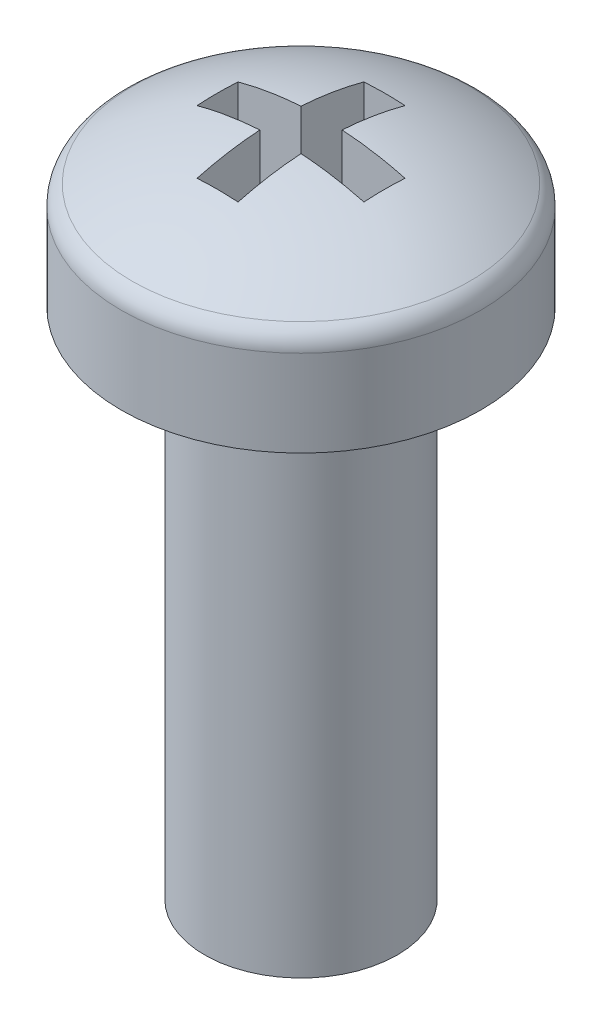
ISO-10303-21;
HEADER;
FILE_DESCRIPTION(('STEP AP214'),'2;1');
FILE_NAME('part.step','',(''),(''),'','','');
FILE_SCHEMA(('AUTOMOTIVE_DESIGN { 1 0 10303 214 1 1 1 1 }'));
ENDSEC;
DATA;
#1=APPLICATION_CONTEXT('core data for automotive mechanical design processes');
#2=APPLICATION_PROTOCOL_DEFINITION('international standard','automotive_design',2000,#1);
#3=PRODUCT_CONTEXT('',#1,'mechanical');
#4=PRODUCT('Part','Part','',(#3));
#5=PRODUCT_RELATED_PRODUCT_CATEGORY('part','',(#4));
#6=PRODUCT_DEFINITION_FORMATION('','',#4);
#7=PRODUCT_DEFINITION_CONTEXT('part definition',#1,'design');
#8=PRODUCT_DEFINITION('design','',#6,#7);
#9=PRODUCT_DEFINITION_SHAPE('','',#8);
#10=(LENGTH_UNIT() NAMED_UNIT(*) SI_UNIT(.MILLI.,.METRE.));
#11=(NAMED_UNIT(*) PLANE_ANGLE_UNIT() SI_UNIT($,.RADIAN.));
#12=(NAMED_UNIT(*) SI_UNIT($,.STERADIAN.) SOLID_ANGLE_UNIT());
#13=UNCERTAINTY_MEASURE_WITH_UNIT(LENGTH_MEASURE(1.E-05),#10,'distance_accuracy_value','');
#14=(GEOMETRIC_REPRESENTATION_CONTEXT(3) GLOBAL_UNCERTAINTY_ASSIGNED_CONTEXT((#13)) GLOBAL_UNIT_ASSIGNED_CONTEXT((#10,
#11,#12)) REPRESENTATION_CONTEXT('',''));
#15=CARTESIAN_POINT('',(0.,0.,0.));
#16=DIRECTION('',(0.,0.,1.));
#17=DIRECTION('',(1.,0.,0.));
#18=AXIS2_PLACEMENT_3D('',#15,#16,#17);
#19=CARTESIAN_POINT('',(0.32,0.64,1.3));
#20=DIRECTION('',(1.,0.,0.));
#21=DIRECTION('',(0.,0.,-1.));
#22=AXIS2_PLACEMENT_3D('',#19,#20,#21);
#23=PLANE('',#22);
#24=DIRECTION('',(0.,1.,0.));
#25=VECTOR('',#24,1.);
#26=CARTESIAN_POINT('',(0.320000000000001,0.64,0.32));
#27=LINE('',#26,#25);
#28=CARTESIAN_POINT('',(0.320000000000048,2.37947788427662,0.319999999999969));
#29=VERTEX_POINT('',#28);
#30=CARTESIAN_POINT('',(0.320000000000001,0.64,0.32));
#31=VERTEX_POINT('',#30);
#32=EDGE_CURVE('E94',#29,#31,#27,.F.);
#33=ORIENTED_EDGE('',*,*,#32,.T.);
#34=DIRECTION('',(0.,0.,-1.));
#35=VECTOR('',#34,1.);
#36=CARTESIAN_POINT('',(0.32,0.64,1.3));
#37=LINE('',#36,#35);
#38=CARTESIAN_POINT('',(0.32,0.64,1.3));
#39=VERTEX_POINT('',#38);
#40=EDGE_CURVE('E95',#39,#31,#37,.T.);
#41=ORIENTED_EDGE('',*,*,#40,.F.);
#42=DIRECTION('',(0.,1.,0.));
#43=VECTOR('',#42,1.);
#44=CARTESIAN_POINT('',(0.32,0.64,1.3));
#45=LINE('',#44,#43);
#46=CARTESIAN_POINT('',(0.32,2.21742669897529,1.3));
#47=VERTEX_POINT('',#46);
#48=EDGE_CURVE('E86',#47,#39,#45,.F.);
#49=ORIENTED_EDGE('',*,*,#48,.F.);
#50=CARTESIAN_POINT('',(0.319999999999999,-2.6,0.));
#51=DIRECTION('',(1.,0.,0.));
#52=DIRECTION('',(0.,0.,-1.));
#53=AXIS2_PLACEMENT_3D('',#50,#51,#52);
#54=CIRCLE('',#53,4.98974949271003);
#55=EDGE_CURVE('E19',#29,#47,#54,.T.);
#56=ORIENTED_EDGE('',*,*,#55,.F.);
#57=EDGE_LOOP('',(#33,#41,#49,#56));
#58=FACE_BOUND('',#57,.T.);
#59=ADVANCED_FACE('F16',(#58),#23,.F.);
#60=CARTESIAN_POINT('',(0.32,0.64,0.32));
#61=DIRECTION('',(0.,0.,1.));
#62=DIRECTION('',(1.,0.,0.));
#63=AXIS2_PLACEMENT_3D('',#60,#61,#62);
#64=PLANE('',#63);
#65=DIRECTION('',(0.,1.,0.));
#66=VECTOR('',#65,1.);
#67=CARTESIAN_POINT('',(1.3,0.64,0.32));
#68=LINE('',#67,#66);
#69=CARTESIAN_POINT('',(1.3,2.21742669897529,0.32));
#70=VERTEX_POINT('',#69);
#71=CARTESIAN_POINT('',(1.3,0.64,0.32));
#72=VERTEX_POINT('',#71);
#73=EDGE_CURVE('E227',#70,#72,#68,.F.);
#74=ORIENTED_EDGE('',*,*,#73,.T.);
#75=DIRECTION('',(1.,0.,0.));
#76=VECTOR('',#75,1.);
#77=CARTESIAN_POINT('',(0.32,0.64,0.32));
#78=LINE('',#77,#76);
#79=EDGE_CURVE('E248',#31,#72,#78,.T.);
#80=ORIENTED_EDGE('',*,*,#79,.F.);
#81=ORIENTED_EDGE('',*,*,#32,.F.);
#82=CARTESIAN_POINT('',(1.3,2.21742669897529,0.32));
#83=CARTESIAN_POINT('',(1.13936164818204,2.26073305501907,0.32000000000001));
#84=CARTESIAN_POINT('',(0.977375805606398,2.29589049848273,0.32000000000001));
#85=CARTESIAN_POINT('',(0.650709138939763,2.34990756024984,0.31999999999999));
#86=CARTESIAN_POINT('',(0.486028314848768,2.36876717855329,0.319999999999969));
#87=CARTESIAN_POINT('',(0.320000000000096,2.37947788427662,0.319999999999939));
#88=B_SPLINE_CURVE_WITH_KNOTS('',3,(#82,#83,#84,#85,#86,#87),.UNSPECIFIED.,.F.,.F.,(4,2,4),(0.,
0.497271687543708,0.994543375087416),.UNSPECIFIED.);
#89=EDGE_CURVE('E92',#70,#29,#88,.T.);
#90=ORIENTED_EDGE('',*,*,#89,.F.);
#91=EDGE_LOOP('',(#74,#80,#81,#90));
#92=FACE_BOUND('',#91,.T.);
#93=ADVANCED_FACE('F262',(#92),#64,.F.);
#94=CARTESIAN_POINT('',(-0.32,0.64,-0.32));
#95=DIRECTION('',(0.,0.,-1.));
#96=DIRECTION('',(-1.,0.,0.));
#97=AXIS2_PLACEMENT_3D('',#94,#95,#96);
#98=PLANE('',#97);
#99=DIRECTION('',(0.,1.,0.));
#100=VECTOR('',#99,1.);
#101=CARTESIAN_POINT('',(-1.3,0.64,-0.32));
#102=LINE('',#101,#100);
#103=CARTESIAN_POINT('',(-1.3,0.64,-0.32));
#104=VERTEX_POINT('',#103);
#105=CARTESIAN_POINT('',(-1.3,2.21742669897529,-0.32));
#106=VERTEX_POINT('',#105);
#107=EDGE_CURVE('E238',#104,#106,#102,.T.);
#108=ORIENTED_EDGE('',*,*,#107,.F.);
#109=DIRECTION('',(-1.,0.,0.));
#110=VECTOR('',#109,1.);
#111=CARTESIAN_POINT('',(-0.32,0.64,-0.32));
#112=LINE('',#111,#110);
#113=CARTESIAN_POINT('',(-0.32,0.64,-0.32));
#114=VERTEX_POINT('',#113);
#115=EDGE_CURVE('E240',#114,#104,#112,.T.);
#116=ORIENTED_EDGE('',*,*,#115,.F.);
#117=DIRECTION('',(0.,1.,0.));
#118=VECTOR('',#117,1.);
#119=CARTESIAN_POINT('',(-0.32,0.64,-0.32));
#120=LINE('',#119,#118);
#121=CARTESIAN_POINT('',(-0.320000000000047,2.37947788427662,-0.319999999999972));
#122=VERTEX_POINT('',#121);
#123=EDGE_CURVE('E216',#114,#122,#120,.T.);
#124=ORIENTED_EDGE('',*,*,#123,.T.);
#125=CARTESIAN_POINT('',(-1.3,2.21742669897529,-0.319999999999997));
#126=CARTESIAN_POINT('',(-1.13936164818204,2.26073305501907,-0.320000000000008));
#127=CARTESIAN_POINT('',(-0.977375805606398,2.29589049848273,-0.320000000000009));
#128=CARTESIAN_POINT('',(-0.650709138939762,2.34990756024984,-0.319999999999991));
#129=CARTESIAN_POINT('',(-0.486028314848767,2.36876717855329,-0.319999999999971));
#130=CARTESIAN_POINT('',(-0.320000000000095,2.37947788427662,-0.319999999999941));
#131=B_SPLINE_CURVE_WITH_KNOTS('',3,(#125,#126,#127,#128,#129,#130),.UNSPECIFIED.,.F.,.F.,(4,2,
4),(0.,0.497271687543709,0.994543375087418),.UNSPECIFIED.);
#132=EDGE_CURVE('E231',#106,#122,#131,.T.);
#133=ORIENTED_EDGE('',*,*,#132,.F.);
#134=EDGE_LOOP('',(#108,#116,#124,#133));
#135=FACE_BOUND('',#134,.T.);
#136=ADVANCED_FACE('F265',(#135),#98,.F.);
#137=CARTESIAN_POINT('',(1.3,0.64,0.32));
#138=DIRECTION('',(1.,0.,0.));
#139=DIRECTION('',(0.,0.,-1.));
#140=AXIS2_PLACEMENT_3D('',#137,#138,#139);
#141=PLANE('',#140);
#142=DIRECTION('',(0.,1.,0.));
#143=VECTOR('',#142,1.);
#144=CARTESIAN_POINT('',(1.3,0.64,-0.32));
#145=LINE('',#144,#143);
#146=CARTESIAN_POINT('',(1.3,2.21742669897529,-0.319999999999999));
#147=VERTEX_POINT('',#146);
#148=CARTESIAN_POINT('',(1.3,0.64,-0.32));
#149=VERTEX_POINT('',#148);
#150=EDGE_CURVE('E205',#147,#149,#145,.F.);
#151=ORIENTED_EDGE('',*,*,#150,.T.);
#152=DIRECTION('',(0.,0.,-1.));
#153=VECTOR('',#152,1.);
#154=CARTESIAN_POINT('',(1.3,0.64,0.32));
#155=LINE('',#154,#153);
#156=EDGE_CURVE('E230',#72,#149,#155,.T.);
#157=ORIENTED_EDGE('',*,*,#156,.F.);
#158=ORIENTED_EDGE('',*,*,#73,.F.);
#159=CARTESIAN_POINT('',(1.3,-2.6,0.));
#160=DIRECTION('',(1.,0.,0.));
#161=DIRECTION('',(0.,0.,-1.));
#162=AXIS2_PLACEMENT_3D('',#159,#160,#161);
#163=CIRCLE('',#162,4.82804308182932);
#164=EDGE_CURVE('E224',#147,#70,#163,.T.);
#165=ORIENTED_EDGE('',*,*,#164,.F.);
#166=EDGE_LOOP('',(#151,#157,#158,#165));
#167=FACE_BOUND('',#166,.T.);
#168=ADVANCED_FACE('F270',(#167),#141,.F.);
#169=CARTESIAN_POINT('',(-0.32,0.64,-1.3));
#170=DIRECTION('',(-1.,0.,0.));
#171=DIRECTION('',(0.,0.,1.));
#172=AXIS2_PLACEMENT_3D('',#169,#170,#171);
#173=PLANE('',#172);
#174=ORIENTED_EDGE('',*,*,#123,.F.);
#175=DIRECTION('',(0.,0.,1.));
#176=VECTOR('',#175,1.);
#177=CARTESIAN_POINT('',(-0.32,0.64,-1.3));
#178=LINE('',#177,#176);
#179=CARTESIAN_POINT('',(-0.32,0.64,-1.3));
#180=VERTEX_POINT('',#179);
#181=EDGE_CURVE('E219',#180,#114,#178,.T.);
#182=ORIENTED_EDGE('',*,*,#181,.F.);
#183=DIRECTION('',(0.,1.,0.));
#184=VECTOR('',#183,1.);
#185=CARTESIAN_POINT('',(-0.32,0.64,-1.3));
#186=LINE('',#185,#184);
#187=CARTESIAN_POINT('',(-0.320000000000001,2.21742669897529,-1.3));
#188=VERTEX_POINT('',#187);
#189=EDGE_CURVE('E190',#180,#188,#186,.T.);
#190=ORIENTED_EDGE('',*,*,#189,.T.);
#191=CARTESIAN_POINT('',(-0.320000000000001,-2.6,0.));
#192=DIRECTION('',(1.,0.,0.));
#193=DIRECTION('',(0.,0.,-1.));
#194=AXIS2_PLACEMENT_3D('',#191,#192,#193);
#195=CIRCLE('',#194,4.98974949271003);
#196=EDGE_CURVE('E209',#122,#188,#195,.F.);
#197=ORIENTED_EDGE('',*,*,#196,.F.);
#198=EDGE_LOOP('',(#174,#182,#190,#197));
#199=FACE_BOUND('',#198,.T.);
#200=ADVANCED_FACE('F274',(#199),#173,.F.);
#201=CARTESIAN_POINT('',(1.3,0.64,-0.32));
#202=DIRECTION('',(0.,0.,-1.));
#203=DIRECTION('',(-1.,0.,0.));
#204=AXIS2_PLACEMENT_3D('',#201,#202,#203);
#205=PLANE('',#204);
#206=DIRECTION('',(0.,1.,0.));
#207=VECTOR('',#206,1.);
#208=CARTESIAN_POINT('',(0.32,0.64,-0.320000000000001));
#209=LINE('',#208,#207);
#210=CARTESIAN_POINT('',(0.32,2.37947788427662,-0.320000000000002));
#211=VERTEX_POINT('',#210);
#212=CARTESIAN_POINT('',(0.32,0.64,-0.320000000000001));
#213=VERTEX_POINT('',#212);
#214=EDGE_CURVE('E182',#211,#213,#209,.F.);
#215=ORIENTED_EDGE('',*,*,#214,.T.);
#216=DIRECTION('',(-1.,0.,0.));
#217=VECTOR('',#216,1.);
#218=CARTESIAN_POINT('',(1.3,0.64,-0.32));
#219=LINE('',#218,#217);
#220=EDGE_CURVE('E208',#149,#213,#219,.T.);
#221=ORIENTED_EDGE('',*,*,#220,.F.);
#222=ORIENTED_EDGE('',*,*,#150,.F.);
#223=CARTESIAN_POINT('',(0.320000000000001,2.37947788427662,-0.320000000000003));
#224=CARTESIAN_POINT('',(0.48602831484869,2.36876717855329,-0.320000000000002));
#225=CARTESIAN_POINT('',(0.650709138939701,2.34990756024985,-0.320000000000001));
#226=CARTESIAN_POINT('',(0.977375805606367,2.29589049848274,-0.319999999999999));
#227=CARTESIAN_POINT('',(1.13936164818202,2.26073305501907,-0.319999999999998));
#228=CARTESIAN_POINT('',(1.3,2.21742669897529,-0.319999999999997));
#229=B_SPLINE_CURVE_WITH_KNOTS('',3,(#223,#224,#225,#226,#227,#228),.UNSPECIFIED.,.F.,.F.,(4,2,
4),(0.,0.497271687543756,0.994543375087511),.UNSPECIFIED.);
#230=EDGE_CURVE('E198',#211,#147,#229,.T.);
#231=ORIENTED_EDGE('',*,*,#230,.F.);
#232=EDGE_LOOP('',(#215,#221,#222,#231));
#233=FACE_BOUND('',#232,.T.);
#234=ADVANCED_FACE('F278',(#233),#205,.F.);
#235=CARTESIAN_POINT('',(0.32,0.64,-1.3));
#236=DIRECTION('',(0.,0.,-1.));
#237=DIRECTION('',(-1.,0.,0.));
#238=AXIS2_PLACEMENT_3D('',#235,#236,#237);
#239=PLANE('',#238);
#240=ORIENTED_EDGE('',*,*,#189,.F.);
#241=DIRECTION('',(-1.,0.,0.));
#242=VECTOR('',#241,1.);
#243=CARTESIAN_POINT('',(0.32,0.64,-1.3));
#244=LINE('',#243,#242);
#245=CARTESIAN_POINT('',(0.32,0.64,-1.3));
#246=VERTEX_POINT('',#245);
#247=EDGE_CURVE('E193',#246,#180,#244,.T.);
#248=ORIENTED_EDGE('',*,*,#247,.F.);
#249=DIRECTION('',(0.,1.,0.));
#250=VECTOR('',#249,1.);
#251=CARTESIAN_POINT('',(0.32,0.64,-1.3));
#252=LINE('',#251,#250);
#253=CARTESIAN_POINT('',(0.32,2.21742669897529,-1.3));
#254=VERTEX_POINT('',#253);
#255=EDGE_CURVE('E179',#246,#254,#252,.T.);
#256=ORIENTED_EDGE('',*,*,#255,.T.);
#257=CARTESIAN_POINT('',(-0.320000000000001,2.21742669897529,-1.3));
#258=CARTESIAN_POINT('',(-0.213333333333334,2.22450428754465,-1.3));
#259=CARTESIAN_POINT('',(-0.106666666666667,2.22804308182933,-1.3));
#260=CARTESIAN_POINT('',(0.106666666666666,2.22804308182933,-1.3));
#261=CARTESIAN_POINT('',(0.213333333333333,2.22450428754465,-1.3));
#262=CARTESIAN_POINT('',(0.32,2.21742669897529,-1.3));
#263=B_SPLINE_CURVE_WITH_KNOTS('',3,(#257,#258,#259,#260,#261,#262),.UNSPECIFIED.,.F.,.F.,(4,2,
4),(0.,0.320176057169963,0.640352114339926),.UNSPECIFIED.);
#264=EDGE_CURVE('E187',#188,#254,#263,.T.);
#265=ORIENTED_EDGE('',*,*,#264,.F.);
#266=EDGE_LOOP('',(#240,#248,#256,#265));
#267=FACE_BOUND('',#266,.T.);
#268=ADVANCED_FACE('F283',(#267),#239,.F.);
#269=CARTESIAN_POINT('',(0.32,0.64,-0.32));
#270=DIRECTION('',(1.,0.,0.));
#271=DIRECTION('',(0.,0.,-1.));
#272=AXIS2_PLACEMENT_3D('',#269,#270,#271);
#273=PLANE('',#272);
#274=ORIENTED_EDGE('',*,*,#255,.F.);
#275=DIRECTION('',(0.,0.,1.));
#276=VECTOR('',#275,1.);
#277=CARTESIAN_POINT('',(0.32,0.64,0.));
#278=LINE('',#277,#276);
#279=EDGE_CURVE('E163',#213,#246,#278,.F.);
#280=ORIENTED_EDGE('',*,*,#279,.F.);
#281=ORIENTED_EDGE('',*,*,#214,.F.);
#282=CARTESIAN_POINT('',(0.319999999999999,-2.6,0.));
#283=DIRECTION('',(1.,0.,0.));
#284=DIRECTION('',(0.,0.,-1.));
#285=AXIS2_PLACEMENT_3D('',#282,#283,#284);
#286=CIRCLE('',#285,4.98974949271003);
#287=EDGE_CURVE('E100',#254,#211,#286,.T.);
#288=ORIENTED_EDGE('',*,*,#287,.F.);
#289=EDGE_LOOP('',(#274,#280,#281,#288));
#290=FACE_BOUND('',#289,.T.);
#291=ADVANCED_FACE('F340',(#290),#273,.F.);
#292=CARTESIAN_POINT('',(-0.32,0.64,1.3));
#293=DIRECTION('',(0.,0.,1.));
#294=DIRECTION('',(1.,0.,0.));
#295=AXIS2_PLACEMENT_3D('',#292,#293,#294);
#296=PLANE('',#295);
#297=ORIENTED_EDGE('',*,*,#48,.T.);
#298=DIRECTION('',(1.,0.,0.));
#299=VECTOR('',#298,1.);
#300=CARTESIAN_POINT('',(0.,0.64,1.3));
#301=LINE('',#300,#299);
#302=CARTESIAN_POINT('',(-0.32,0.64,1.3));
#303=VERTEX_POINT('',#302);
#304=EDGE_CURVE('E173',#303,#39,#301,.T.);
#305=ORIENTED_EDGE('',*,*,#304,.F.);
#306=DIRECTION('',(0.,1.,0.));
#307=VECTOR('',#306,1.);
#308=CARTESIAN_POINT('',(-0.32,0.64,1.3));
#309=LINE('',#308,#307);
#310=CARTESIAN_POINT('',(-0.320000000000001,2.21742669897529,1.3));
#311=VERTEX_POINT('',#310);
#312=EDGE_CURVE('E98',#303,#311,#309,.T.);
#313=ORIENTED_EDGE('',*,*,#312,.T.);
#314=CARTESIAN_POINT('',(0.32,2.21742669897529,1.3));
#315=CARTESIAN_POINT('',(0.213333333333333,2.22450428754465,1.3));
#316=CARTESIAN_POINT('',(0.106666666666666,2.22804308182933,1.3));
#317=CARTESIAN_POINT('',(-0.106666666666667,2.22804308182933,1.3));
#318=CARTESIAN_POINT('',(-0.213333333333334,2.22450428754465,1.3));
#319=CARTESIAN_POINT('',(-0.32,2.21742669897529,1.3));
#320=B_SPLINE_CURVE_WITH_KNOTS('',3,(#314,#315,#316,#317,#318,#319),.UNSPECIFIED.,.F.,.F.,(4,2,
4),(0.,0.320176057169963,0.640352114339926),.UNSPECIFIED.);
#321=EDGE_CURVE('E89',#47,#311,#320,.T.);
#322=ORIENTED_EDGE('',*,*,#321,.F.);
#323=EDGE_LOOP('',(#297,#305,#313,#322));
#324=FACE_BOUND('',#323,.T.);
#325=ADVANCED_FACE('F96',(#324),#296,.F.);
#326=CARTESIAN_POINT('',(-1.3,0.64,-0.32));
#327=DIRECTION('',(-1.,0.,0.));
#328=DIRECTION('',(0.,0.,1.));
#329=AXIS2_PLACEMENT_3D('',#326,#327,#328);
#330=PLANE('',#329);
#331=DIRECTION('',(0.,1.,0.));
#332=VECTOR('',#331,1.);
#333=CARTESIAN_POINT('',(-1.3,0.64,0.32));
#334=LINE('',#333,#332);
#335=CARTESIAN_POINT('',(-1.3,2.21742669897529,0.32));
#336=VERTEX_POINT('',#335);
#337=CARTESIAN_POINT('',(-1.3,0.64,0.32));
#338=VERTEX_POINT('',#337);
#339=EDGE_CURVE('E152',#336,#338,#334,.F.);
#340=ORIENTED_EDGE('',*,*,#339,.T.);
#341=DIRECTION('',(0.,0.,1.));
#342=VECTOR('',#341,1.);
#343=CARTESIAN_POINT('',(-1.3,0.64,0.));
#344=LINE('',#343,#342);
#345=EDGE_CURVE('E170',#104,#338,#344,.T.);
#346=ORIENTED_EDGE('',*,*,#345,.F.);
#347=ORIENTED_EDGE('',*,*,#107,.T.);
#348=CARTESIAN_POINT('',(-1.3,-2.6,0.));
#349=DIRECTION('',(1.,0.,0.));
#350=DIRECTION('',(0.,0.,-1.));
#351=AXIS2_PLACEMENT_3D('',#348,#349,#350);
#352=CIRCLE('',#351,4.82804308182932);
#353=EDGE_CURVE('E99',#336,#106,#352,.F.);
#354=ORIENTED_EDGE('',*,*,#353,.F.);
#355=EDGE_LOOP('',(#340,#346,#347,#354));
#356=FACE_BOUND('',#355,.T.);
#357=ADVANCED_FACE('F348',(#356),#330,.F.);
#358=CARTESIAN_POINT('',(0.,0.64,0.));
#359=DIRECTION('',(0.,1.,0.));
#360=DIRECTION('',(0.,0.,1.));
#361=AXIS2_PLACEMENT_3D('',#358,#359,#360);
#362=PLANE('',#361);
#363=ORIENTED_EDGE('',*,*,#279,.T.);
#364=ORIENTED_EDGE('',*,*,#247,.T.);
#365=ORIENTED_EDGE('',*,*,#181,.T.);
#366=ORIENTED_EDGE('',*,*,#115,.T.);
#367=ORIENTED_EDGE('',*,*,#345,.T.);
#368=DIRECTION('',(1.,0.,0.));
#369=VECTOR('',#368,1.);
#370=CARTESIAN_POINT('',(-1.3,0.64,0.32));
#371=LINE('',#370,#369);
#372=CARTESIAN_POINT('',(-0.32,0.64,0.32));
#373=VERTEX_POINT('',#372);
#374=EDGE_CURVE('E149',#338,#373,#371,.T.);
#375=ORIENTED_EDGE('',*,*,#374,.T.);
#376=DIRECTION('',(0.,0.,1.));
#377=VECTOR('',#376,1.);
#378=CARTESIAN_POINT('',(-0.32,0.64,0.32));
#379=LINE('',#378,#377);
#380=EDGE_CURVE('E158',#373,#303,#379,.T.);
#381=ORIENTED_EDGE('',*,*,#380,.T.);
#382=ORIENTED_EDGE('',*,*,#304,.T.);
#383=ORIENTED_EDGE('',*,*,#40,.T.);
#384=ORIENTED_EDGE('',*,*,#79,.T.);
#385=ORIENTED_EDGE('',*,*,#156,.T.);
#386=ORIENTED_EDGE('',*,*,#220,.T.);
#387=EDGE_LOOP('',(#363,#364,#365,#366,#367,#375,#381,#382,#383,#384,#385,#386));
#388=FACE_BOUND('',#387,.T.);
#389=ADVANCED_FACE('F316',(#388),#362,.T.);
#390=CARTESIAN_POINT('',(-0.32,0.64,0.32));
#391=DIRECTION('',(-1.,0.,0.));
#392=DIRECTION('',(0.,0.,1.));
#393=AXIS2_PLACEMENT_3D('',#390,#391,#392);
#394=PLANE('',#393);
#395=ORIENTED_EDGE('',*,*,#312,.F.);
#396=ORIENTED_EDGE('',*,*,#380,.F.);
#397=DIRECTION('',(0.,1.,0.));
#398=VECTOR('',#397,1.);
#399=CARTESIAN_POINT('',(-0.32,0.64,0.32));
#400=LINE('',#399,#398);
#401=CARTESIAN_POINT('',(-0.32,2.37947788427662,0.32));
#402=VERTEX_POINT('',#401);
#403=EDGE_CURVE('E129',#373,#402,#400,.T.);
#404=ORIENTED_EDGE('',*,*,#403,.T.);
#405=CARTESIAN_POINT('',(-0.320000000000001,-2.6,0.));
#406=DIRECTION('',(1.,0.,0.));
#407=DIRECTION('',(0.,0.,-1.));
#408=AXIS2_PLACEMENT_3D('',#405,#406,#407);
#409=CIRCLE('',#408,4.98974949271003);
#410=EDGE_CURVE('E34',#311,#402,#409,.F.);
#411=ORIENTED_EDGE('',*,*,#410,.F.);
#412=EDGE_LOOP('',(#395,#396,#404,#411));
#413=FACE_BOUND('',#412,.T.);
#414=ADVANCED_FACE('F322',(#413),#394,.F.);
#415=CARTESIAN_POINT('',(-1.3,0.64,0.32));
#416=DIRECTION('',(0.,0.,1.));
#417=DIRECTION('',(1.,0.,0.));
#418=AXIS2_PLACEMENT_3D('',#415,#416,#417);
#419=PLANE('',#418);
#420=ORIENTED_EDGE('',*,*,#403,.F.);
#421=ORIENTED_EDGE('',*,*,#374,.F.);
#422=ORIENTED_EDGE('',*,*,#339,.F.);
#423=CARTESIAN_POINT('',(-0.319999999999999,2.37947788427662,0.32));
#424=CARTESIAN_POINT('',(-0.486028314848688,2.36876717855329,0.32));
#425=CARTESIAN_POINT('',(-0.6507091389397,2.34990756024985,0.32));
#426=CARTESIAN_POINT('',(-0.977375805606367,2.29589049848274,0.32));
#427=CARTESIAN_POINT('',(-1.13936164818202,2.26073305501907,0.32));
#428=CARTESIAN_POINT('',(-1.3,2.21742669897529,0.32));
#429=B_SPLINE_CURVE_WITH_KNOTS('',3,(#423,#424,#425,#426,#427,#428),.UNSPECIFIED.,.F.,.F.,(4,2,
4),(0.,0.497271687543757,0.994543375087513),.UNSPECIFIED.);
#430=EDGE_CURVE('E122',#402,#336,#429,.T.);
#431=ORIENTED_EDGE('',*,*,#430,.F.);
#432=EDGE_LOOP('',(#420,#421,#422,#431));
#433=FACE_BOUND('',#432,.T.);
#434=ADVANCED_FACE('F131',(#433),#419,.F.);
#435=CARTESIAN_POINT('',(0.,-2.6,0.));
#436=DIRECTION('',(1.,0.,0.));
#437=DIRECTION('',(0.,1.,0.));
#438=AXIS2_PLACEMENT_3D('',#435,#436,#437);
#439=SPHERICAL_SURFACE('',#438,5.);
#440=CARTESIAN_POINT('',(0.,1.65284929318952,0.));
#441=DIRECTION('',(0.,-1.,0.));
#442=DIRECTION('',(0.,0.,-1.));
#443=AXIS2_PLACEMENT_3D('',#440,#441,#442);
#444=CIRCLE('',#443,2.62931034482758);
#445=CARTESIAN_POINT('',(0.,1.65284929318952,-2.62931034482758));
#446=VERTEX_POINT('',#445);
#447=EDGE_CURVE('E119',#446,#446,#444,.T.);
#448=ORIENTED_EDGE('',*,*,#447,.F.);
#449=EDGE_LOOP('',(#448));
#450=FACE_BOUND('',#449,.T.);
#451=ORIENTED_EDGE('',*,*,#410,.T.);
#452=ORIENTED_EDGE('',*,*,#430,.T.);
#453=ORIENTED_EDGE('',*,*,#353,.T.);
#454=ORIENTED_EDGE('',*,*,#132,.T.);
#455=ORIENTED_EDGE('',*,*,#196,.T.);
#456=ORIENTED_EDGE('',*,*,#264,.T.);
#457=ORIENTED_EDGE('',*,*,#287,.T.);
#458=ORIENTED_EDGE('',*,*,#230,.T.);
#459=ORIENTED_EDGE('',*,*,#164,.T.);
#460=ORIENTED_EDGE('',*,*,#89,.T.);
#461=ORIENTED_EDGE('',*,*,#55,.T.);
#462=ORIENTED_EDGE('',*,*,#321,.T.);
#463=EDGE_LOOP('',(#451,#452,#453,#454,#455,#456,#457,#458,#459,#460,#461,#462));
#464=FACE_BOUND('',#463,.T.);
#465=ADVANCED_FACE('F88',(#450,#464),#439,.T.);
#466=CARTESIAN_POINT('',(0.,1.34664414407988,0.));
#467=DIRECTION('',(0.,-1.,0.));
#468=DIRECTION('',(0.,0.,-1.));
#469=AXIS2_PLACEMENT_3D('',#466,#467,#468);
#470=TOROIDAL_SURFACE('',#469,2.43999999999999,0.36);
#471=CARTESIAN_POINT('',(0.,1.34664414407988,0.));
#472=DIRECTION('',(0.,-1.,0.));
#473=DIRECTION('',(1.,0.,0.));
#474=AXIS2_PLACEMENT_3D('',#471,#472,#473);
#475=CIRCLE('',#474,2.79999999999999);
#476=CARTESIAN_POINT('',(2.79999999999999,1.34664414407988,0.));
#477=VERTEX_POINT('',#476);
#478=EDGE_CURVE('E118',#477,#477,#475,.T.);
#479=ORIENTED_EDGE('',*,*,#478,.F.);
#480=EDGE_LOOP('',(#479));
#481=FACE_BOUND('',#480,.T.);
#482=ORIENTED_EDGE('',*,*,#447,.T.);
#483=EDGE_LOOP('',(#482));
#484=FACE_BOUND('',#483,.T.);
#485=ADVANCED_FACE('F138',(#481,#484),#470,.T.);
#486=CARTESIAN_POINT('',(0.,2.92,0.));
#487=DIRECTION('',(0.,-1.,0.));
#488=DIRECTION('',(1.,0.,0.));
#489=AXIS2_PLACEMENT_3D('',#486,#487,#488);
#490=CYLINDRICAL_SURFACE('',#489,2.79999999999999);
#491=CARTESIAN_POINT('',(0.,0.,0.));
#492=DIRECTION('',(0.,-1.,0.));
#493=DIRECTION('',(1.,0.,0.));
#494=AXIS2_PLACEMENT_3D('',#491,#492,#493);
#495=CIRCLE('',#494,2.79999999999999);
#496=CARTESIAN_POINT('',(2.79999999999999,0.,0.));
#497=VERTEX_POINT('',#496);
#498=EDGE_CURVE('E115',#497,#497,#495,.T.);
#499=ORIENTED_EDGE('',*,*,#498,.F.);
#500=EDGE_LOOP('',(#499));
#501=FACE_BOUND('',#500,.T.);
#502=ORIENTED_EDGE('',*,*,#478,.T.);
#503=EDGE_LOOP('',(#502));
#504=FACE_BOUND('',#503,.T.);
#505=ADVANCED_FACE('F369',(#501,#504),#490,.T.);
#506=CARTESIAN_POINT('',(0.,0.,0.));
#507=DIRECTION('',(0.,-1.,0.));
#508=DIRECTION('',(1.,0.,0.));
#509=AXIS2_PLACEMENT_3D('',#506,#507,#508);
#510=PLANE('',#509);
#511=CARTESIAN_POINT('',(0.,0.,0.));
#512=DIRECTION('',(0.,-1.,0.));
#513=DIRECTION('',(1.,0.,0.));
#514=AXIS2_PLACEMENT_3D('',#511,#512,#513);
#515=CIRCLE('',#514,1.5);
#516=CARTESIAN_POINT('',(1.5,0.,0.));
#517=VERTEX_POINT('',#516);
#518=EDGE_CURVE('E25',#517,#517,#515,.T.);
#519=ORIENTED_EDGE('',*,*,#518,.F.);
#520=EDGE_LOOP('',(#519));
#521=FACE_BOUND('',#520,.T.);
#522=ORIENTED_EDGE('',*,*,#498,.T.);
#523=EDGE_LOOP('',(#522));
#524=FACE_BOUND('',#523,.T.);
#525=ADVANCED_FACE('F363',(#521,#524),#510,.T.);
#526=CARTESIAN_POINT('',(0.,-8.,0.));
#527=DIRECTION('',(0.,-1.,0.));
#528=DIRECTION('',(1.,0.,0.));
#529=AXIS2_PLACEMENT_3D('',#526,#527,#528);
#530=PLANE('',#529);
#531=CARTESIAN_POINT('',(0.,-8.,0.));
#532=DIRECTION('',(0.,-1.,0.));
#533=DIRECTION('',(1.,0.,0.));
#534=AXIS2_PLACEMENT_3D('',#531,#532,#533);
#535=CIRCLE('',#534,1.5);
#536=CARTESIAN_POINT('',(1.5,-8.,0.));
#537=VERTEX_POINT('',#536);
#538=EDGE_CURVE('E10',#537,#537,#535,.F.);
#539=ORIENTED_EDGE('',*,*,#538,.F.);
#540=EDGE_LOOP('',(#539));
#541=FACE_BOUND('',#540,.T.);
#542=ADVANCED_FACE('F357',(#541),#530,.T.);
#543=CARTESIAN_POINT('',(0.,2.92,0.));
#544=DIRECTION('',(0.,-1.,0.));
#545=DIRECTION('',(1.,0.,0.));
#546=AXIS2_PLACEMENT_3D('',#543,#544,#545);
#547=CYLINDRICAL_SURFACE('',#546,1.5);
#548=ORIENTED_EDGE('',*,*,#538,.T.);
#549=EDGE_LOOP('',(#548));
#550=FACE_BOUND('',#549,.T.);
#551=ORIENTED_EDGE('',*,*,#518,.T.);
#552=EDGE_LOOP('',(#551));
#553=FACE_BOUND('',#552,.T.);
#554=ADVANCED_FACE('F355',(#550,#553),#547,.T.);
#555=CLOSED_SHELL('',(#59,#93,#136,#168,#200,#234,#268,#291,#325,#357,#389,#414,#434,#465,#485,
#505,#525,#542,#554));
#556=MANIFOLD_SOLID_BREP('B1',#555);
#557=ADVANCED_BREP_SHAPE_REPRESENTATION('',(#18,#556),#14);
#558=SHAPE_DEFINITION_REPRESENTATION(#9,#557);
ENDSEC;
END-ISO-10303-21;
